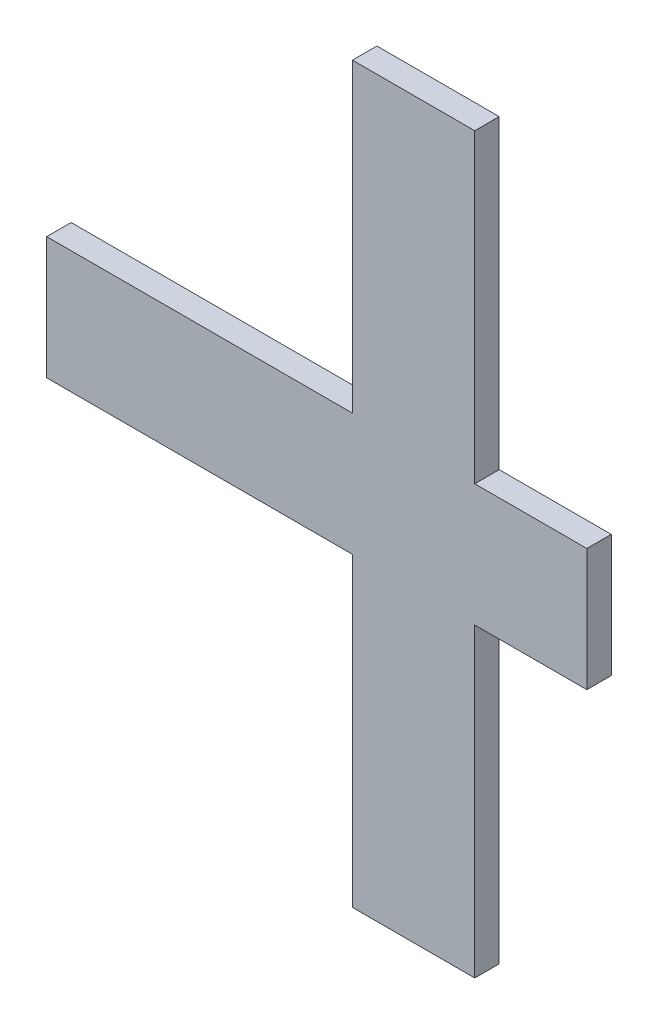
ISO-10303-21;
HEADER;
FILE_DESCRIPTION(('STEP AP214'),'2;1');
FILE_NAME('part.step','',(''),(''),'','','');
FILE_SCHEMA(('AUTOMOTIVE_DESIGN { 1 0 10303 214 1 1 1 1 }'));
ENDSEC;
DATA;
#1=APPLICATION_CONTEXT('core data for automotive mechanical design processes');
#2=APPLICATION_PROTOCOL_DEFINITION('international standard','automotive_design',2000,#1);
#3=PRODUCT_CONTEXT('',#1,'mechanical');
#4=PRODUCT('Part','Part','',(#3));
#5=PRODUCT_RELATED_PRODUCT_CATEGORY('part','',(#4));
#6=PRODUCT_DEFINITION_FORMATION('','',#4);
#7=PRODUCT_DEFINITION_CONTEXT('part definition',#1,'design');
#8=PRODUCT_DEFINITION('design','',#6,#7);
#9=PRODUCT_DEFINITION_SHAPE('','',#8);
#10=(LENGTH_UNIT() NAMED_UNIT(*) SI_UNIT(.MILLI.,.METRE.));
#11=(NAMED_UNIT(*) PLANE_ANGLE_UNIT() SI_UNIT($,.RADIAN.));
#12=(NAMED_UNIT(*) SI_UNIT($,.STERADIAN.) SOLID_ANGLE_UNIT());
#13=UNCERTAINTY_MEASURE_WITH_UNIT(LENGTH_MEASURE(1.E-05),#10,'distance_accuracy_value','');
#14=(GEOMETRIC_REPRESENTATION_CONTEXT(3) GLOBAL_UNCERTAINTY_ASSIGNED_CONTEXT((#13)) GLOBAL_UNIT_ASSIGNED_CONTEXT((#10,
#11,#12)) REPRESENTATION_CONTEXT('',''));
#15=CARTESIAN_POINT('',(0.,0.,0.));
#16=DIRECTION('',(0.,0.,1.));
#17=DIRECTION('',(1.,0.,0.));
#18=AXIS2_PLACEMENT_3D('',#15,#16,#17);
#19=CARTESIAN_POINT('',(75.,0.,6.));
#20=DIRECTION('',(-1.,0.,0.));
#21=DIRECTION('',(0.,0.,1.));
#22=AXIS2_PLACEMENT_3D('',#19,#20,#21);
#23=PLANE('',#22);
#24=DIRECTION('',(0.,1.,0.));
#25=VECTOR('',#24,1.);
#26=CARTESIAN_POINT('',(75.,0.,0.));
#27=LINE('',#26,#25);
#28=CARTESIAN_POINT('',(75.,0.,0.));
#29=VERTEX_POINT('',#28);
#30=CARTESIAN_POINT('',(75.,75.,0.));
#31=VERTEX_POINT('',#30);
#32=EDGE_CURVE('E164',#29,#31,#27,.T.);
#33=ORIENTED_EDGE('',*,*,#32,.F.);
#34=DIRECTION('',(0.,0.,-1.));
#35=VECTOR('',#34,1.);
#36=CARTESIAN_POINT('',(75.,0.,6.));
#37=LINE('',#36,#35);
#38=CARTESIAN_POINT('',(75.,0.,6.));
#39=VERTEX_POINT('',#38);
#40=EDGE_CURVE('E11',#39,#29,#37,.T.);
#41=ORIENTED_EDGE('',*,*,#40,.F.);
#42=DIRECTION('',(0.,1.,0.));
#43=VECTOR('',#42,1.);
#44=CARTESIAN_POINT('',(75.,0.,6.));
#45=LINE('',#44,#43);
#46=CARTESIAN_POINT('',(75.,75.,6.));
#47=VERTEX_POINT('',#46);
#48=EDGE_CURVE('E203',#39,#47,#45,.T.);
#49=ORIENTED_EDGE('',*,*,#48,.T.);
#50=DIRECTION('',(0.,0.,-1.));
#51=VECTOR('',#50,1.);
#52=CARTESIAN_POINT('',(75.,75.,6.));
#53=LINE('',#52,#51);
#54=EDGE_CURVE('E104',#47,#31,#53,.T.);
#55=ORIENTED_EDGE('',*,*,#54,.T.);
#56=EDGE_LOOP('',(#33,#41,#49,#55));
#57=FACE_BOUND('',#56,.T.);
#58=ADVANCED_FACE('F41',(#57),#23,.T.);
#59=CARTESIAN_POINT('',(0.,0.,6.));
#60=DIRECTION('',(0.,1.,0.));
#61=DIRECTION('',(0.,0.,1.));
#62=AXIS2_PLACEMENT_3D('',#59,#60,#61);
#63=PLANE('',#62);
#64=DIRECTION('',(1.,0.,0.));
#65=VECTOR('',#64,1.);
#66=CARTESIAN_POINT('',(0.,0.,0.));
#67=LINE('',#66,#65);
#68=CARTESIAN_POINT('',(105.,0.,0.));
#69=VERTEX_POINT('',#68);
#70=EDGE_CURVE('E168',#29,#69,#67,.T.);
#71=ORIENTED_EDGE('',*,*,#70,.T.);
#72=DIRECTION('',(0.,0.,-1.));
#73=VECTOR('',#72,1.);
#74=CARTESIAN_POINT('',(105.,0.,6.));
#75=LINE('',#74,#73);
#76=CARTESIAN_POINT('',(105.,0.,6.));
#77=VERTEX_POINT('',#76);
#78=EDGE_CURVE('E50',#77,#69,#75,.T.);
#79=ORIENTED_EDGE('',*,*,#78,.F.);
#80=DIRECTION('',(1.,0.,0.));
#81=VECTOR('',#80,1.);
#82=CARTESIAN_POINT('',(0.,0.,6.));
#83=LINE('',#82,#81);
#84=EDGE_CURVE('E258',#39,#77,#83,.T.);
#85=ORIENTED_EDGE('',*,*,#84,.F.);
#86=ORIENTED_EDGE('',*,*,#40,.T.);
#87=EDGE_LOOP('',(#71,#79,#85,#86));
#88=FACE_BOUND('',#87,.T.);
#89=ADVANCED_FACE('F288',(#88),#63,.F.);
#90=CARTESIAN_POINT('',(105.,0.,6.));
#91=DIRECTION('',(-1.,0.,0.));
#92=DIRECTION('',(0.,0.,1.));
#93=AXIS2_PLACEMENT_3D('',#90,#91,#92);
#94=PLANE('',#93);
#95=DIRECTION('',(0.,1.,0.));
#96=VECTOR('',#95,1.);
#97=CARTESIAN_POINT('',(105.,0.,0.));
#98=LINE('',#97,#96);
#99=CARTESIAN_POINT('',(105.,75.,0.));
#100=VERTEX_POINT('',#99);
#101=EDGE_CURVE('E171',#69,#100,#98,.T.);
#102=ORIENTED_EDGE('',*,*,#101,.T.);
#103=DIRECTION('',(0.,0.,-1.));
#104=VECTOR('',#103,1.);
#105=CARTESIAN_POINT('',(105.,75.,6.));
#106=LINE('',#105,#104);
#107=CARTESIAN_POINT('',(105.,75.,6.));
#108=VERTEX_POINT('',#107);
#109=EDGE_CURVE('E226',#108,#100,#106,.T.);
#110=ORIENTED_EDGE('',*,*,#109,.F.);
#111=DIRECTION('',(0.,1.,0.));
#112=VECTOR('',#111,1.);
#113=CARTESIAN_POINT('',(105.,0.,6.));
#114=LINE('',#113,#112);
#115=EDGE_CURVE('E236',#77,#108,#114,.T.);
#116=ORIENTED_EDGE('',*,*,#115,.F.);
#117=ORIENTED_EDGE('',*,*,#78,.T.);
#118=EDGE_LOOP('',(#102,#110,#116,#117));
#119=FACE_BOUND('',#118,.T.);
#120=ADVANCED_FACE('F234',(#119),#94,.F.);
#121=CARTESIAN_POINT('',(0.,75.,6.));
#122=DIRECTION('',(0.,-1.,0.));
#123=DIRECTION('',(0.,0.,-1.));
#124=AXIS2_PLACEMENT_3D('',#121,#122,#123);
#125=PLANE('',#124);
#126=DIRECTION('',(-1.,0.,0.));
#127=VECTOR('',#126,1.);
#128=CARTESIAN_POINT('',(0.,75.,0.));
#129=LINE('',#128,#127);
#130=CARTESIAN_POINT('',(132.5,75.,0.));
#131=VERTEX_POINT('',#130);
#132=EDGE_CURVE('E175',#131,#100,#129,.T.);
#133=ORIENTED_EDGE('',*,*,#132,.F.);
#134=DIRECTION('',(0.,0.,-1.));
#135=VECTOR('',#134,1.);
#136=CARTESIAN_POINT('',(132.5,75.,6.));
#137=LINE('',#136,#135);
#138=CARTESIAN_POINT('',(132.5,75.,6.));
#139=VERTEX_POINT('',#138);
#140=EDGE_CURVE('E223',#139,#131,#137,.T.);
#141=ORIENTED_EDGE('',*,*,#140,.F.);
#142=DIRECTION('',(-1.,0.,0.));
#143=VECTOR('',#142,1.);
#144=CARTESIAN_POINT('',(0.,75.,6.));
#145=LINE('',#144,#143);
#146=EDGE_CURVE('E248',#139,#108,#145,.T.);
#147=ORIENTED_EDGE('',*,*,#146,.T.);
#148=ORIENTED_EDGE('',*,*,#109,.T.);
#149=EDGE_LOOP('',(#133,#141,#147,#148));
#150=FACE_BOUND('',#149,.T.);
#151=ADVANCED_FACE('F245',(#150),#125,.T.);
#152=CARTESIAN_POINT('',(132.5,0.,6.));
#153=DIRECTION('',(1.,0.,0.));
#154=DIRECTION('',(0.,0.,-1.));
#155=AXIS2_PLACEMENT_3D('',#152,#153,#154);
#156=PLANE('',#155);
#157=DIRECTION('',(0.,-1.,0.));
#158=VECTOR('',#157,1.);
#159=CARTESIAN_POINT('',(132.5,0.,0.));
#160=LINE('',#159,#158);
#161=CARTESIAN_POINT('',(132.5,105.,0.));
#162=VERTEX_POINT('',#161);
#163=EDGE_CURVE('E180',#162,#131,#160,.T.);
#164=ORIENTED_EDGE('',*,*,#163,.F.);
#165=DIRECTION('',(0.,0.,-1.));
#166=VECTOR('',#165,1.);
#167=CARTESIAN_POINT('',(132.5,105.,6.));
#168=LINE('',#167,#166);
#169=CARTESIAN_POINT('',(132.5,105.,6.));
#170=VERTEX_POINT('',#169);
#171=EDGE_CURVE('E220',#170,#162,#168,.T.);
#172=ORIENTED_EDGE('',*,*,#171,.F.);
#173=DIRECTION('',(0.,-1.,0.));
#174=VECTOR('',#173,1.);
#175=CARTESIAN_POINT('',(132.5,0.,6.));
#176=LINE('',#175,#174);
#177=EDGE_CURVE('E252',#170,#139,#176,.T.);
#178=ORIENTED_EDGE('',*,*,#177,.T.);
#179=ORIENTED_EDGE('',*,*,#140,.T.);
#180=EDGE_LOOP('',(#164,#172,#178,#179));
#181=FACE_BOUND('',#180,.T.);
#182=ADVANCED_FACE('F298',(#181),#156,.T.);
#183=CARTESIAN_POINT('',(0.,105.,6.));
#184=DIRECTION('',(0.,-1.,0.));
#185=DIRECTION('',(0.,0.,-1.));
#186=AXIS2_PLACEMENT_3D('',#183,#184,#185);
#187=PLANE('',#186);
#188=DIRECTION('',(-1.,0.,0.));
#189=VECTOR('',#188,1.);
#190=CARTESIAN_POINT('',(0.,105.,0.));
#191=LINE('',#190,#189);
#192=CARTESIAN_POINT('',(105.,105.,0.));
#193=VERTEX_POINT('',#192);
#194=EDGE_CURVE('E184',#162,#193,#191,.T.);
#195=ORIENTED_EDGE('',*,*,#194,.T.);
#196=DIRECTION('',(0.,0.,-1.));
#197=VECTOR('',#196,1.);
#198=CARTESIAN_POINT('',(105.,105.,6.));
#199=LINE('',#198,#197);
#200=CARTESIAN_POINT('',(105.,105.,6.));
#201=VERTEX_POINT('',#200);
#202=EDGE_CURVE('E216',#201,#193,#199,.T.);
#203=ORIENTED_EDGE('',*,*,#202,.F.);
#204=DIRECTION('',(-1.,0.,0.));
#205=VECTOR('',#204,1.);
#206=CARTESIAN_POINT('',(0.,105.,6.));
#207=LINE('',#206,#205);
#208=EDGE_CURVE('E256',#170,#201,#207,.T.);
#209=ORIENTED_EDGE('',*,*,#208,.F.);
#210=ORIENTED_EDGE('',*,*,#171,.T.);
#211=EDGE_LOOP('',(#195,#203,#209,#210));
#212=FACE_BOUND('',#211,.T.);
#213=ADVANCED_FACE('F301',(#212),#187,.F.);
#214=CARTESIAN_POINT('',(105.,180.,0.));
#215=VERTEX_POINT('',#214);
#216=EDGE_CURVE('E176',#193,#215,#98,.T.);
#217=ORIENTED_EDGE('',*,*,#216,.T.);
#218=DIRECTION('',(0.,0.,-1.));
#219=VECTOR('',#218,1.);
#220=CARTESIAN_POINT('',(105.,180.,6.));
#221=LINE('',#220,#219);
#222=CARTESIAN_POINT('',(105.,180.,6.));
#223=VERTEX_POINT('',#222);
#224=EDGE_CURVE('E213',#223,#215,#221,.T.);
#225=ORIENTED_EDGE('',*,*,#224,.F.);
#226=EDGE_CURVE('E260',#201,#223,#114,.T.);
#227=ORIENTED_EDGE('',*,*,#226,.F.);
#228=ORIENTED_EDGE('',*,*,#202,.T.);
#229=EDGE_LOOP('',(#217,#225,#227,#228));
#230=FACE_BOUND('',#229,.T.);
#231=ADVANCED_FACE('F276',(#230),#94,.F.);
#232=CARTESIAN_POINT('',(0.,180.,6.));
#233=DIRECTION('',(0.,1.,0.));
#234=DIRECTION('',(-1.,0.,0.));
#235=AXIS2_PLACEMENT_3D('',#232,#233,#234);
#236=PLANE('',#235);
#237=DIRECTION('',(1.,0.,0.));
#238=VECTOR('',#237,1.);
#239=CARTESIAN_POINT('',(0.,180.,0.));
#240=LINE('',#239,#238);
#241=CARTESIAN_POINT('',(75.,180.,0.));
#242=VERTEX_POINT('',#241);
#243=EDGE_CURVE('E187',#242,#215,#240,.T.);
#244=ORIENTED_EDGE('',*,*,#243,.F.);
#245=DIRECTION('',(0.,0.,-1.));
#246=VECTOR('',#245,1.);
#247=CARTESIAN_POINT('',(75.,180.,6.));
#248=LINE('',#247,#246);
#249=CARTESIAN_POINT('',(75.,180.,6.));
#250=VERTEX_POINT('',#249);
#251=EDGE_CURVE('E210',#250,#242,#248,.T.);
#252=ORIENTED_EDGE('',*,*,#251,.F.);
#253=DIRECTION('',(1.,0.,0.));
#254=VECTOR('',#253,1.);
#255=CARTESIAN_POINT('',(0.,180.,6.));
#256=LINE('',#255,#254);
#257=EDGE_CURVE('E265',#250,#223,#256,.T.);
#258=ORIENTED_EDGE('',*,*,#257,.T.);
#259=ORIENTED_EDGE('',*,*,#224,.T.);
#260=EDGE_LOOP('',(#244,#252,#258,#259));
#261=FACE_BOUND('',#260,.T.);
#262=ADVANCED_FACE('F280',(#261),#236,.T.);
#263=CARTESIAN_POINT('',(75.,0.,6.));
#264=DIRECTION('',(1.,0.,0.));
#265=DIRECTION('',(0.,0.,-1.));
#266=AXIS2_PLACEMENT_3D('',#263,#264,#265);
#267=PLANE('',#266);
#268=DIRECTION('',(0.,-1.,0.));
#269=VECTOR('',#268,1.);
#270=CARTESIAN_POINT('',(75.,0.,0.));
#271=LINE('',#270,#269);
#272=CARTESIAN_POINT('',(75.,105.,0.));
#273=VERTEX_POINT('',#272);
#274=EDGE_CURVE('E191',#242,#273,#271,.T.);
#275=ORIENTED_EDGE('',*,*,#274,.T.);
#276=DIRECTION('',(0.,0.,-1.));
#277=VECTOR('',#276,1.);
#278=CARTESIAN_POINT('',(75.,105.,6.));
#279=LINE('',#278,#277);
#280=CARTESIAN_POINT('',(75.,105.,6.));
#281=VERTEX_POINT('',#280);
#282=EDGE_CURVE('E147',#281,#273,#279,.T.);
#283=ORIENTED_EDGE('',*,*,#282,.F.);
#284=DIRECTION('',(0.,-1.,0.));
#285=VECTOR('',#284,1.);
#286=CARTESIAN_POINT('',(75.,0.,6.));
#287=LINE('',#286,#285);
#288=EDGE_CURVE('E153',#250,#281,#287,.T.);
#289=ORIENTED_EDGE('',*,*,#288,.F.);
#290=ORIENTED_EDGE('',*,*,#251,.T.);
#291=EDGE_LOOP('',(#275,#283,#289,#290));
#292=FACE_BOUND('',#291,.T.);
#293=ADVANCED_FACE('F283',(#292),#267,.F.);
#294=CARTESIAN_POINT('',(0.,105.,6.));
#295=DIRECTION('',(0.,1.,0.));
#296=DIRECTION('',(0.,0.,1.));
#297=AXIS2_PLACEMENT_3D('',#294,#295,#296);
#298=PLANE('',#297);
#299=DIRECTION('',(1.,0.,0.));
#300=VECTOR('',#299,1.);
#301=CARTESIAN_POINT('',(0.,105.,0.));
#302=LINE('',#301,#300);
#303=CARTESIAN_POINT('',(0.,105.,0.));
#304=VERTEX_POINT('',#303);
#305=EDGE_CURVE('E141',#304,#273,#302,.T.);
#306=ORIENTED_EDGE('',*,*,#305,.F.);
#307=DIRECTION('',(0.,0.,-1.));
#308=VECTOR('',#307,1.);
#309=CARTESIAN_POINT('',(0.,105.,6.));
#310=LINE('',#309,#308);
#311=CARTESIAN_POINT('',(0.,105.,6.));
#312=VERTEX_POINT('',#311);
#313=EDGE_CURVE('E136',#312,#304,#310,.T.);
#314=ORIENTED_EDGE('',*,*,#313,.F.);
#315=DIRECTION('',(1.,0.,0.));
#316=VECTOR('',#315,1.);
#317=CARTESIAN_POINT('',(0.,105.,6.));
#318=LINE('',#317,#316);
#319=EDGE_CURVE('E139',#312,#281,#318,.T.);
#320=ORIENTED_EDGE('',*,*,#319,.T.);
#321=ORIENTED_EDGE('',*,*,#282,.T.);
#322=EDGE_LOOP('',(#306,#314,#320,#321));
#323=FACE_BOUND('',#322,.T.);
#324=ADVANCED_FACE('F138',(#323),#298,.T.);
#325=CARTESIAN_POINT('',(0.,0.,6.));
#326=DIRECTION('',(-1.,0.,0.));
#327=DIRECTION('',(0.,0.,1.));
#328=AXIS2_PLACEMENT_3D('',#325,#326,#327);
#329=PLANE('',#328);
#330=DIRECTION('',(0.,1.,0.));
#331=VECTOR('',#330,1.);
#332=CARTESIAN_POINT('',(0.,0.,0.));
#333=LINE('',#332,#331);
#334=CARTESIAN_POINT('',(0.,75.,0.));
#335=VERTEX_POINT('',#334);
#336=EDGE_CURVE('E197',#335,#304,#333,.T.);
#337=ORIENTED_EDGE('',*,*,#336,.F.);
#338=DIRECTION('',(0.,0.,-1.));
#339=VECTOR('',#338,1.);
#340=CARTESIAN_POINT('',(0.,75.,6.));
#341=LINE('',#340,#339);
#342=CARTESIAN_POINT('',(0.,75.,6.));
#343=VERTEX_POINT('',#342);
#344=EDGE_CURVE('E97',#343,#335,#341,.T.);
#345=ORIENTED_EDGE('',*,*,#344,.F.);
#346=DIRECTION('',(0.,1.,0.));
#347=VECTOR('',#346,1.);
#348=CARTESIAN_POINT('',(0.,0.,6.));
#349=LINE('',#348,#347);
#350=EDGE_CURVE('E150',#343,#312,#349,.T.);
#351=ORIENTED_EDGE('',*,*,#350,.T.);
#352=ORIENTED_EDGE('',*,*,#313,.T.);
#353=EDGE_LOOP('',(#337,#345,#351,#352));
#354=FACE_BOUND('',#353,.T.);
#355=ADVANCED_FACE('F157',(#354),#329,.T.);
#356=CARTESIAN_POINT('',(0.,75.,6.));
#357=DIRECTION('',(0.,1.,0.));
#358=DIRECTION('',(0.,0.,1.));
#359=AXIS2_PLACEMENT_3D('',#356,#357,#358);
#360=PLANE('',#359);
#361=DIRECTION('',(1.,0.,0.));
#362=VECTOR('',#361,1.);
#363=CARTESIAN_POINT('',(0.,75.,0.));
#364=LINE('',#363,#362);
#365=EDGE_CURVE('E200',#335,#31,#364,.T.);
#366=ORIENTED_EDGE('',*,*,#365,.T.);
#367=ORIENTED_EDGE('',*,*,#54,.F.);
#368=DIRECTION('',(1.,0.,0.));
#369=VECTOR('',#368,1.);
#370=CARTESIAN_POINT('',(0.,75.,6.));
#371=LINE('',#370,#369);
#372=EDGE_CURVE('E58',#343,#47,#371,.T.);
#373=ORIENTED_EDGE('',*,*,#372,.F.);
#374=ORIENTED_EDGE('',*,*,#344,.T.);
#375=EDGE_LOOP('',(#366,#367,#373,#374));
#376=FACE_BOUND('',#375,.T.);
#377=ADVANCED_FACE('F284',(#376),#360,.F.);
#378=CARTESIAN_POINT('',(0.,0.,6.));
#379=DIRECTION('',(0.,0.,1.));
#380=DIRECTION('',(1.,0.,0.));
#381=AXIS2_PLACEMENT_3D('',#378,#379,#380);
#382=PLANE('',#381);
#383=ORIENTED_EDGE('',*,*,#48,.F.);
#384=ORIENTED_EDGE('',*,*,#84,.T.);
#385=ORIENTED_EDGE('',*,*,#115,.T.);
#386=ORIENTED_EDGE('',*,*,#146,.F.);
#387=ORIENTED_EDGE('',*,*,#177,.F.);
#388=ORIENTED_EDGE('',*,*,#208,.T.);
#389=ORIENTED_EDGE('',*,*,#226,.T.);
#390=ORIENTED_EDGE('',*,*,#257,.F.);
#391=ORIENTED_EDGE('',*,*,#288,.T.);
#392=ORIENTED_EDGE('',*,*,#319,.F.);
#393=ORIENTED_EDGE('',*,*,#350,.F.);
#394=ORIENTED_EDGE('',*,*,#372,.T.);
#395=EDGE_LOOP('',(#383,#384,#385,#386,#387,#388,#389,#390,#391,#392,#393,#394));
#396=FACE_BOUND('',#395,.T.);
#397=ADVANCED_FACE('F149',(#396),#382,.T.);
#398=CARTESIAN_POINT('',(0.,0.,0.));
#399=DIRECTION('',(0.,0.,1.));
#400=DIRECTION('',(1.,0.,0.));
#401=AXIS2_PLACEMENT_3D('',#398,#399,#400);
#402=PLANE('',#401);
#403=ORIENTED_EDGE('',*,*,#32,.T.);
#404=ORIENTED_EDGE('',*,*,#365,.F.);
#405=ORIENTED_EDGE('',*,*,#336,.T.);
#406=ORIENTED_EDGE('',*,*,#305,.T.);
#407=ORIENTED_EDGE('',*,*,#274,.F.);
#408=ORIENTED_EDGE('',*,*,#243,.T.);
#409=ORIENTED_EDGE('',*,*,#216,.F.);
#410=ORIENTED_EDGE('',*,*,#194,.F.);
#411=ORIENTED_EDGE('',*,*,#163,.T.);
#412=ORIENTED_EDGE('',*,*,#132,.T.);
#413=ORIENTED_EDGE('',*,*,#101,.F.);
#414=ORIENTED_EDGE('',*,*,#70,.F.);
#415=EDGE_LOOP('',(#403,#404,#405,#406,#407,#408,#409,#410,#411,#412,#413,#414));
#416=FACE_BOUND('',#415,.T.);
#417=ADVANCED_FACE('F240',(#416),#402,.F.);
#418=CLOSED_SHELL('',(#58,#89,#120,#151,#182,#213,#231,#262,#293,#324,#355,#377,#397,#417));
#419=MANIFOLD_SOLID_BREP('B2',#418);
#420=ADVANCED_BREP_SHAPE_REPRESENTATION('',(#18,#419),#14);
#421=SHAPE_DEFINITION_REPRESENTATION(#9,#420);
ENDSEC;
END-ISO-10303-21;
